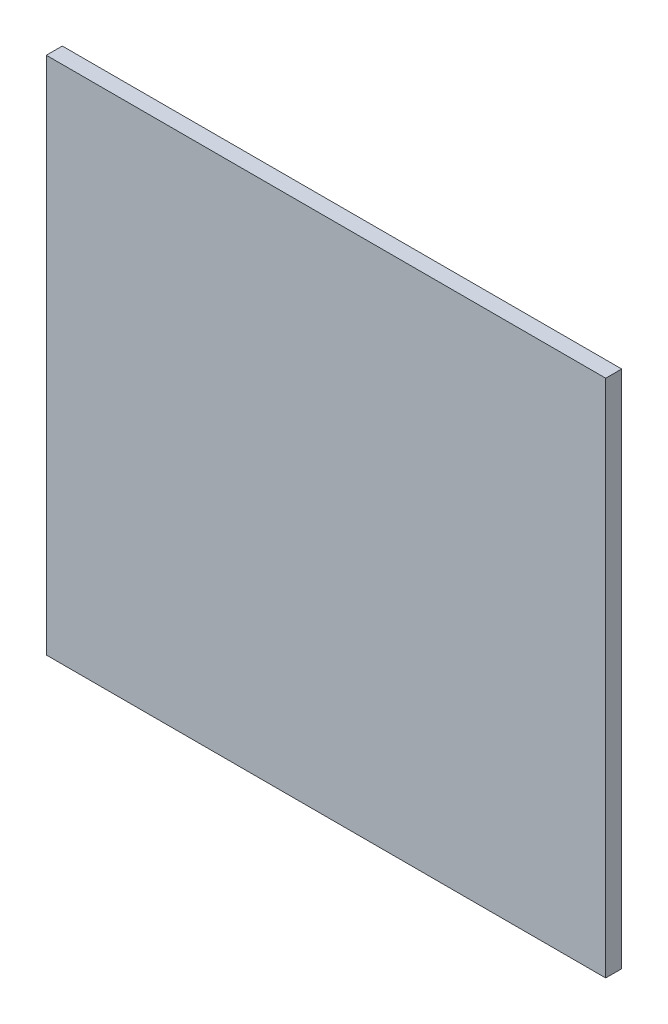
ISO-10303-21;
HEADER;
FILE_DESCRIPTION(('STEP AP214'),'2;1');
FILE_NAME('part.step','',(''),(''),'','','');
FILE_SCHEMA(('AUTOMOTIVE_DESIGN { 1 0 10303 214 1 1 1 1 }'));
ENDSEC;
DATA;
#1=APPLICATION_CONTEXT('core data for automotive mechanical design processes');
#2=APPLICATION_PROTOCOL_DEFINITION('international standard','automotive_design',2000,#1);
#3=PRODUCT_CONTEXT('',#1,'mechanical');
#4=PRODUCT('Part','Part','',(#3));
#5=PRODUCT_RELATED_PRODUCT_CATEGORY('part','',(#4));
#6=PRODUCT_DEFINITION_FORMATION('','',#4);
#7=PRODUCT_DEFINITION_CONTEXT('part definition',#1,'design');
#8=PRODUCT_DEFINITION('design','',#6,#7);
#9=PRODUCT_DEFINITION_SHAPE('','',#8);
#10=(LENGTH_UNIT() NAMED_UNIT(*) SI_UNIT(.MILLI.,.METRE.));
#11=(NAMED_UNIT(*) PLANE_ANGLE_UNIT() SI_UNIT($,.RADIAN.));
#12=(NAMED_UNIT(*) SI_UNIT($,.STERADIAN.) SOLID_ANGLE_UNIT());
#13=UNCERTAINTY_MEASURE_WITH_UNIT(LENGTH_MEASURE(1.E-05),#10,'distance_accuracy_value','');
#14=(GEOMETRIC_REPRESENTATION_CONTEXT(3) GLOBAL_UNCERTAINTY_ASSIGNED_CONTEXT((#13)) GLOBAL_UNIT_ASSIGNED_CONTEXT((#10,
#11,#12)) REPRESENTATION_CONTEXT('',''));
#15=CARTESIAN_POINT('',(0.,0.,0.));
#16=DIRECTION('',(0.,0.,1.));
#17=DIRECTION('',(1.,0.,0.));
#18=AXIS2_PLACEMENT_3D('',#15,#16,#17);
#19=CARTESIAN_POINT('',(70.,-65.,4.));
#20=DIRECTION('',(-1.,0.,0.));
#21=DIRECTION('',(0.,0.,1.));
#22=AXIS2_PLACEMENT_3D('',#19,#20,#21);
#23=PLANE('',#22);
#24=DIRECTION('',(0.,1.,0.));
#25=VECTOR('',#24,1.);
#26=CARTESIAN_POINT('',(70.,-65.,0.));
#27=LINE('',#26,#25);
#28=CARTESIAN_POINT('',(70.,-65.,0.));
#29=VERTEX_POINT('',#28);
#30=CARTESIAN_POINT('',(70.,65.,0.));
#31=VERTEX_POINT('',#30);
#32=EDGE_CURVE('E97',#29,#31,#27,.T.);
#33=ORIENTED_EDGE('',*,*,#32,.T.);
#34=DIRECTION('',(0.,0.,-1.));
#35=VECTOR('',#34,1.);
#36=CARTESIAN_POINT('',(70.,65.,4.));
#37=LINE('',#36,#35);
#38=CARTESIAN_POINT('',(70.,65.,4.));
#39=VERTEX_POINT('',#38);
#40=EDGE_CURVE('E11',#39,#31,#37,.T.);
#41=ORIENTED_EDGE('',*,*,#40,.F.);
#42=DIRECTION('',(0.,1.,0.));
#43=VECTOR('',#42,1.);
#44=CARTESIAN_POINT('',(70.,-65.,4.));
#45=LINE('',#44,#43);
#46=CARTESIAN_POINT('',(70.,-65.,4.));
#47=VERTEX_POINT('',#46);
#48=EDGE_CURVE('E85',#47,#39,#45,.T.);
#49=ORIENTED_EDGE('',*,*,#48,.F.);
#50=DIRECTION('',(0.,0.,-1.));
#51=VECTOR('',#50,1.);
#52=CARTESIAN_POINT('',(70.,-65.,4.));
#53=LINE('',#52,#51);
#54=EDGE_CURVE('E93',#47,#29,#53,.T.);
#55=ORIENTED_EDGE('',*,*,#54,.T.);
#56=EDGE_LOOP('',(#33,#41,#49,#55));
#57=FACE_BOUND('',#56,.T.);
#58=ADVANCED_FACE('F34',(#57),#23,.F.);
#59=CARTESIAN_POINT('',(-70.,65.,4.));
#60=DIRECTION('',(0.,-1.,0.));
#61=DIRECTION('',(0.,0.,-1.));
#62=AXIS2_PLACEMENT_3D('',#59,#60,#61);
#63=PLANE('',#62);
#64=DIRECTION('',(-1.,0.,0.));
#65=VECTOR('',#64,1.);
#66=CARTESIAN_POINT('',(-70.,65.,0.));
#67=LINE('',#66,#65);
#68=CARTESIAN_POINT('',(-70.,65.,0.));
#69=VERTEX_POINT('',#68);
#70=EDGE_CURVE('E89',#31,#69,#67,.T.);
#71=ORIENTED_EDGE('',*,*,#70,.T.);
#72=DIRECTION('',(0.,0.,-1.));
#73=VECTOR('',#72,1.);
#74=CARTESIAN_POINT('',(-70.,65.,4.));
#75=LINE('',#74,#73);
#76=CARTESIAN_POINT('',(-70.,65.,4.));
#77=VERTEX_POINT('',#76);
#78=EDGE_CURVE('E42',#77,#69,#75,.T.);
#79=ORIENTED_EDGE('',*,*,#78,.F.);
#80=DIRECTION('',(-1.,0.,0.));
#81=VECTOR('',#80,1.);
#82=CARTESIAN_POINT('',(-70.,65.,4.));
#83=LINE('',#82,#81);
#84=EDGE_CURVE('E80',#39,#77,#83,.T.);
#85=ORIENTED_EDGE('',*,*,#84,.F.);
#86=ORIENTED_EDGE('',*,*,#40,.T.);
#87=EDGE_LOOP('',(#71,#79,#85,#86));
#88=FACE_BOUND('',#87,.T.);
#89=ADVANCED_FACE('F88',(#88),#63,.F.);
#90=CARTESIAN_POINT('',(-70.,-65.,4.));
#91=DIRECTION('',(1.,0.,0.));
#92=DIRECTION('',(0.,0.,-1.));
#93=AXIS2_PLACEMENT_3D('',#90,#91,#92);
#94=PLANE('',#93);
#95=DIRECTION('',(0.,-1.,0.));
#96=VECTOR('',#95,1.);
#97=CARTESIAN_POINT('',(-70.,-65.,0.));
#98=LINE('',#97,#96);
#99=CARTESIAN_POINT('',(-70.,-65.,0.));
#100=VERTEX_POINT('',#99);
#101=EDGE_CURVE('E67',#69,#100,#98,.T.);
#102=ORIENTED_EDGE('',*,*,#101,.T.);
#103=DIRECTION('',(0.,0.,-1.));
#104=VECTOR('',#103,1.);
#105=CARTESIAN_POINT('',(-70.,-65.,4.));
#106=LINE('',#105,#104);
#107=CARTESIAN_POINT('',(-70.,-65.,4.));
#108=VERTEX_POINT('',#107);
#109=EDGE_CURVE('E90',#108,#100,#106,.T.);
#110=ORIENTED_EDGE('',*,*,#109,.F.);
#111=DIRECTION('',(0.,-1.,0.));
#112=VECTOR('',#111,1.);
#113=CARTESIAN_POINT('',(-70.,-65.,4.));
#114=LINE('',#113,#112);
#115=EDGE_CURVE('E83',#77,#108,#114,.T.);
#116=ORIENTED_EDGE('',*,*,#115,.F.);
#117=ORIENTED_EDGE('',*,*,#78,.T.);
#118=EDGE_LOOP('',(#102,#110,#116,#117));
#119=FACE_BOUND('',#118,.T.);
#120=ADVANCED_FACE('F91',(#119),#94,.F.);
#121=CARTESIAN_POINT('',(-70.,-65.,4.));
#122=DIRECTION('',(0.,1.,0.));
#123=DIRECTION('',(0.,0.,1.));
#124=AXIS2_PLACEMENT_3D('',#121,#122,#123);
#125=PLANE('',#124);
#126=DIRECTION('',(1.,0.,0.));
#127=VECTOR('',#126,1.);
#128=CARTESIAN_POINT('',(-70.,-65.,0.));
#129=LINE('',#128,#127);
#130=EDGE_CURVE('E73',#100,#29,#129,.T.);
#131=ORIENTED_EDGE('',*,*,#130,.T.);
#132=ORIENTED_EDGE('',*,*,#54,.F.);
#133=DIRECTION('',(1.,0.,0.));
#134=VECTOR('',#133,1.);
#135=CARTESIAN_POINT('',(-70.,-65.,4.));
#136=LINE('',#135,#134);
#137=EDGE_CURVE('E50',#108,#47,#136,.T.);
#138=ORIENTED_EDGE('',*,*,#137,.F.);
#139=ORIENTED_EDGE('',*,*,#109,.T.);
#140=EDGE_LOOP('',(#131,#132,#138,#139));
#141=FACE_BOUND('',#140,.T.);
#142=ADVANCED_FACE('F104',(#141),#125,.F.);
#143=CARTESIAN_POINT('',(0.,0.,4.));
#144=DIRECTION('',(0.,0.,-1.));
#145=DIRECTION('',(-1.,0.,0.));
#146=AXIS2_PLACEMENT_3D('',#143,#144,#145);
#147=PLANE('',#146);
#148=ORIENTED_EDGE('',*,*,#48,.T.);
#149=ORIENTED_EDGE('',*,*,#84,.T.);
#150=ORIENTED_EDGE('',*,*,#115,.T.);
#151=ORIENTED_EDGE('',*,*,#137,.T.);
#152=EDGE_LOOP('',(#148,#149,#150,#151));
#153=FACE_BOUND('',#152,.T.);
#154=ADVANCED_FACE('F81',(#153),#147,.F.);
#155=CARTESIAN_POINT('',(0.,0.,0.));
#156=DIRECTION('',(0.,0.,-1.));
#157=DIRECTION('',(-1.,0.,0.));
#158=AXIS2_PLACEMENT_3D('',#155,#156,#157);
#159=PLANE('',#158);
#160=ORIENTED_EDGE('',*,*,#32,.F.);
#161=ORIENTED_EDGE('',*,*,#130,.F.);
#162=ORIENTED_EDGE('',*,*,#101,.F.);
#163=ORIENTED_EDGE('',*,*,#70,.F.);
#164=EDGE_LOOP('',(#160,#161,#162,#163));
#165=FACE_BOUND('',#164,.T.);
#166=ADVANCED_FACE('F107',(#165),#159,.T.);
#167=CLOSED_SHELL('',(#58,#89,#120,#142,#154,#166));
#168=MANIFOLD_SOLID_BREP('B2',#167);
#169=ADVANCED_BREP_SHAPE_REPRESENTATION('',(#18,#168),#14);
#170=SHAPE_DEFINITION_REPRESENTATION(#9,#169);
ENDSEC;
END-ISO-10303-21;
